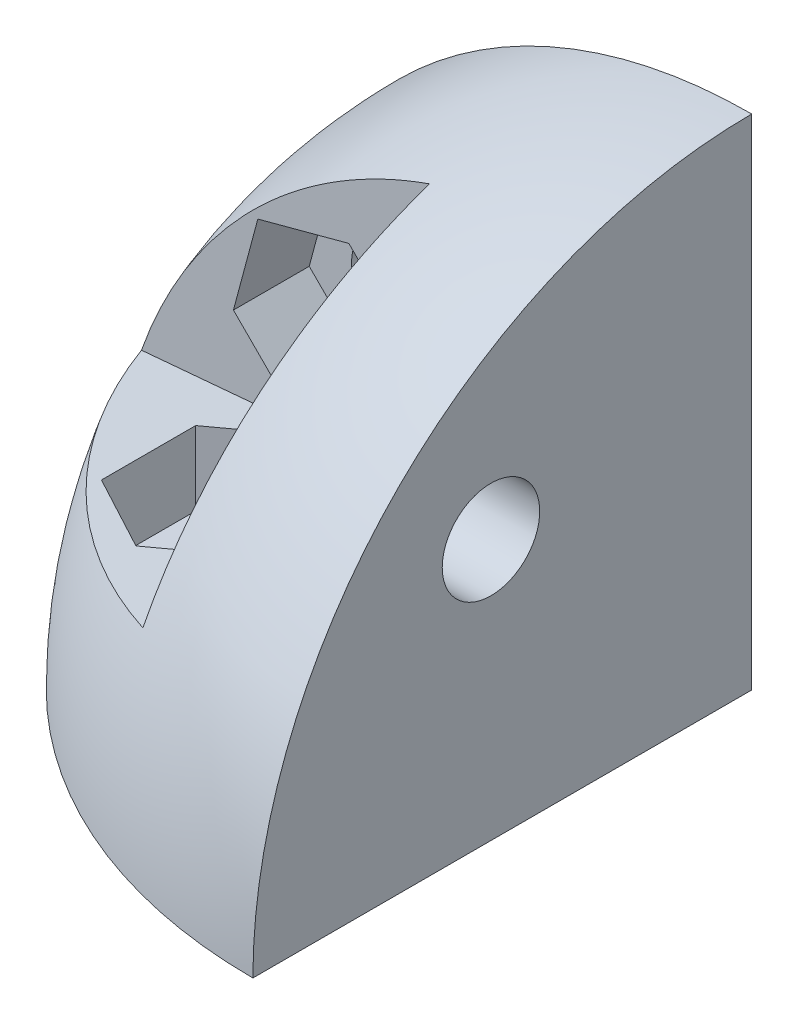
ISO-10303-21;
HEADER;
FILE_DESCRIPTION(('STEP AP214'),'2;1');
FILE_NAME('part.step','',(''),(''),'','','');
FILE_SCHEMA(('AUTOMOTIVE_DESIGN { 1 0 10303 214 1 1 1 1 }'));
ENDSEC;
DATA;
#1=APPLICATION_CONTEXT('core data for automotive mechanical design processes');
#2=APPLICATION_PROTOCOL_DEFINITION('international standard','automotive_design',2000,#1);
#3=PRODUCT_CONTEXT('',#1,'mechanical');
#4=PRODUCT('Part','Part','',(#3));
#5=PRODUCT_RELATED_PRODUCT_CATEGORY('part','',(#4));
#6=PRODUCT_DEFINITION_FORMATION('','',#4);
#7=PRODUCT_DEFINITION_CONTEXT('part definition',#1,'design');
#8=PRODUCT_DEFINITION('design','',#6,#7);
#9=PRODUCT_DEFINITION_SHAPE('','',#8);
#10=(LENGTH_UNIT() NAMED_UNIT(*) SI_UNIT(.MILLI.,.METRE.));
#11=(NAMED_UNIT(*) PLANE_ANGLE_UNIT() SI_UNIT($,.RADIAN.));
#12=(NAMED_UNIT(*) SI_UNIT($,.STERADIAN.) SOLID_ANGLE_UNIT());
#13=UNCERTAINTY_MEASURE_WITH_UNIT(LENGTH_MEASURE(1.E-05),#10,'distance_accuracy_value','');
#14=(GEOMETRIC_REPRESENTATION_CONTEXT(3) GLOBAL_UNCERTAINTY_ASSIGNED_CONTEXT((#13)) GLOBAL_UNIT_ASSIGNED_CONTEXT((#10,
#11,#12)) REPRESENTATION_CONTEXT('',''));
#15=CARTESIAN_POINT('',(0.,0.,0.));
#16=DIRECTION('',(0.,0.,1.));
#17=DIRECTION('',(1.,0.,0.));
#18=AXIS2_PLACEMENT_3D('',#15,#16,#17);
#19=CARTESIAN_POINT('',(-7.90000000000001,7.9,7.34307806183461));
#20=DIRECTION('',(0.,0.,-1.));
#21=DIRECTION('',(0.,1.,0.));
#22=AXIS2_PLACEMENT_3D('',#19,#20,#21);
#23=CONICAL_SURFACE('',#22,3.61416995083759,1.04889691310922);
#24=CARTESIAN_POINT('',(-13.7597303739018,7.16751282172458,6.0254597705994));
#25=CARTESIAN_POINT('',(-13.5178004933912,7.23233773783236,6.16811573450718));
#26=CARTESIAN_POINT('',(-13.2758174682111,7.29717689401142,6.3106760215065));
#27=CARTESIAN_POINT('',(-12.7916215190662,7.4269168075632,6.5954049431576));
#28=CARTESIAN_POINT('',(-12.5494085848063,7.49181756769452,6.73757355903885));
#29=CARTESIAN_POINT('',(-12.064677399873,7.62170089724359,7.02129048229639));
#30=CARTESIAN_POINT('',(-11.8221591838761,7.68668345736979,7.16283885315127));
#31=CARTESIAN_POINT('',(-11.3365695025941,7.81679682032218,7.44489817125003));
#32=CARTESIAN_POINT('',(-11.0934980564342,7.8819276180238,7.58540915366466));
#33=CARTESIAN_POINT('',(-10.7282803815609,7.97978739906767,7.79450328180227));
#34=CARTESIAN_POINT('',(-10.6065486806147,8.01240531002948,7.86386124092355));
#35=CARTESIAN_POINT('',(-10.3626612035475,8.07775476255368,8.00179346856782));
#36=CARTESIAN_POINT('',(-10.2405054007206,8.11048631127194,8.07036768652657));
#37=CARTESIAN_POINT('',(-9.99549346992604,8.17613706026432,8.20632282656691));
#38=CARTESIAN_POINT('',(-9.87263702354366,8.20905634585744,8.27370313749384));
#39=CARTESIAN_POINT('',(-9.68755556730266,8.25864877259119,8.37316938264805));
#40=CARTESIAN_POINT('',(-9.6257325429899,8.27521420202945,8.40605557517843));
#41=CARTESIAN_POINT('',(-9.5017270068239,8.30844138530211,8.47109198849914));
#42=CARTESIAN_POINT('',(-9.43954450226494,8.32510313718203,8.50324222415769));
#43=CARTESIAN_POINT('',(-9.31438674841064,8.35863905625379,8.56667379101767));
#44=CARTESIAN_POINT('',(-9.25140910796897,8.37551386415135,8.59795009460218));
#45=CARTESIAN_POINT('',(-9.1247826143018,8.40944333086985,8.65900342998442));
#46=CARTESIAN_POINT('',(-9.06113381331834,8.42649797569258,8.68878057744725));
#47=CARTESIAN_POINT('',(-8.93280023412669,8.46088485459878,8.74612780535509));
#48=CARTESIAN_POINT('',(-8.86811425358402,8.4782174108468,8.7736950626977));
#49=CARTESIAN_POINT('',(-8.73747712852891,8.51322152300684,8.82532191581052));
#50=CARTESIAN_POINT('',(-8.67152642462045,8.53089296085938,8.84938270891443));
#51=CARTESIAN_POINT('',(-8.51709917536303,8.57227161758726,8.89858079163729));
#52=CARTESIAN_POINT('',(-8.42797068818243,8.59615352374991,8.92174467704258));
#53=CARTESIAN_POINT('',(-8.29269334533905,8.63240097851902,8.94430765209405));
#54=CARTESIAN_POINT('',(-8.24751286721405,8.64450705114627,8.94980011196458));
#55=CARTESIAN_POINT('',(-8.15684785766095,8.66880066723778,8.95615976874845));
#56=CARTESIAN_POINT('',(-8.11136341795623,8.68098818612484,8.95702830300233));
#57=CARTESIAN_POINT('',(-8.02062808185029,8.7053006461594,8.95403125109313));
#58=CARTESIAN_POINT('',(-7.97537691392853,8.7174256600606,8.9501740840513));
#59=CARTESIAN_POINT('',(-7.88540088404932,8.74153466460489,8.93821796007714));
#60=CARTESIAN_POINT('',(-7.84067624732852,8.753518594896,8.93011725078673));
#61=CARTESIAN_POINT('',(-7.75121073540061,8.77749080656753,8.91031176938812));
#62=CARTESIAN_POINT('',(-7.70648224209259,8.78947577022807,8.89854866453492));
#63=CARTESIAN_POINT('',(-7.61778836241368,8.81324122366162,8.87231935173843));
#64=CARTESIAN_POINT('',(-7.57382295375336,8.82502171940705,8.85785322289519));
#65=CARTESIAN_POINT('',(-7.47555382565447,8.85135285292206,8.823018810311));
#66=CARTESIAN_POINT('',(-7.42144028821628,8.86585253157822,8.80208224754278));
#67=CARTESIAN_POINT('',(-7.31402932213911,8.89463321319684,8.75805886758644));
#68=CARTESIAN_POINT('',(-7.26073216014678,8.90891414471156,8.73497136458489));
#69=CARTESIAN_POINT('',(-7.15469912971838,8.93732560958587,8.6872669230047));
#70=CARTESIAN_POINT('',(-7.10196411681242,8.95145591370687,8.66264796041342));
#71=CARTESIAN_POINT('',(-6.99697375247636,8.97958799704376,8.61233414070121));
#72=CARTESIAN_POINT('',(-6.9447184341272,8.99358976739565,8.58663921004837));
#73=CARTESIAN_POINT('',(-6.79523800622912,9.0336429273352,8.51176631682021));
#74=CARTESIAN_POINT('',(-6.69846710412719,9.05957261240425,8.46161856166965));
#75=CARTESIAN_POINT('',(-6.55407764794885,9.0982616505828,8.38529203790327));
#76=CARTESIAN_POINT('',(-6.50615981433516,9.11110119540264,8.35971197804557));
#77=CARTESIAN_POINT('',(-6.41049067542616,9.13673566391389,8.3082297223605));
#78=CARTESIAN_POINT('',(-6.36273935705209,9.14953059110974,8.28232755259743));
#79=CARTESIAN_POINT('',(-6.31505188559596,9.16230841057549,8.25629889736301));
#80=B_SPLINE_CURVE_WITH_KNOTS('',3,(#24,#25,#26,#27,#28,#29,#30,#31,#32,#33,#34,#35,#36,#37,#38,
#39,#40,#41,#42,#43,#44,#45,#46,#47,#48,#49,#50,#51,#52,#53,#54,#55,#56,#57,#58,#59,#60,#61,#62,
#63,#64,#65,#66,#67,#68,#69,#70,#71,#72,#73,#74,#75,#76,#77,#78,#79),.UNSPECIFIED.,.F.,.F.,(4,2,
2,2,2,2,2,2,2,2,2,2,2,2,2,2,2,2,2,2,2,2,2,2,2,2,2,4),(0.,0.864724700397998,1.72949014524256,
2.59416491621447,3.45881023608813,3.8903607357934,4.32193892221933,4.75373199579712,
4.96960360827383,5.18547085573225,5.40239549859914,5.61930337924804,5.83648408132965,
6.05359044923052,6.3379193654596,6.47900690261222,6.62005363194258,6.76084944302319,
6.90170344119894,7.04492678117473,7.18814593058435,7.36749814669508,7.54690774510028,
7.7265597117487,7.90622397595402,8.24229724792111,8.40974197073303,8.57717323139248),.UNSPECIFIED.);
#81=CARTESIAN_POINT('',(-11.5118253101116,7.769837168229,7.34307806183461));
#82=VERTEX_POINT('',#81);
#83=CARTESIAN_POINT('',(-8.56061230866017,8.56061230866016,8.88426609820053));
#84=VERTEX_POINT('',#83);
#85=EDGE_CURVE('E14',#82,#84,#80,.T.);
#86=ORIENTED_EDGE('',*,*,#85,.F.);
#87=CARTESIAN_POINT('',(-7.90000000000001,7.9,7.34307806183461));
#88=DIRECTION('',(0.,0.,1.));
#89=DIRECTION('',(0.,-1.,0.));
#90=AXIS2_PLACEMENT_3D('',#87,#88,#89);
#91=CIRCLE('',#90,3.61416995083759);
#92=CARTESIAN_POINT('',(-11.5,7.58027444028144,7.34307806183461));
#93=VERTEX_POINT('',#92);
#94=EDGE_CURVE('E217',#82,#93,#91,.T.);
#95=ORIENTED_EDGE('',*,*,#94,.T.);
#96=DIRECTION('',(-0.863475111675209,-0.0766875176065022,-0.498527588164224));
#97=VECTOR('',#96,1.);
#98=CARTESIAN_POINT('',(-6.96632954410591,7.98292175252873,9.96059391996213));
#99=LINE('',#98,#97);
#100=CARTESIAN_POINT('',(-7.90000000000001,7.90000000000001,9.42153903091727));
#101=VERTEX_POINT('',#100);
#102=EDGE_CURVE('E513',#101,#93,#99,.T.);
#103=ORIENTED_EDGE('',*,*,#102,.F.);
#104=DIRECTION('',(-0.0766875176064967,-0.863475111675209,0.498527588164224));
#105=VECTOR('',#104,1.);
#106=CARTESIAN_POINT('',(-7.98292175252873,6.96632954410597,9.96059391996209));
#107=LINE('',#106,#105);
#108=CARTESIAN_POINT('',(-7.58027444028147,11.5,7.34307806183461));
#109=VERTEX_POINT('',#108);
#110=EDGE_CURVE('E213',#109,#101,#107,.T.);
#111=ORIENTED_EDGE('',*,*,#110,.F.);
#112=CARTESIAN_POINT('',(-7.76983716822902,11.5118253101116,7.34307806183461));
#113=VERTEX_POINT('',#112);
#114=EDGE_CURVE('E211',#109,#113,#91,.T.);
#115=ORIENTED_EDGE('',*,*,#114,.T.);
#116=CARTESIAN_POINT('',(-9.16230841057553,6.31505188559592,8.25629889736298));
#117=CARTESIAN_POINT('',(-9.15131051884169,6.35609657632275,8.27870128854848));
#118=CARTESIAN_POINT('',(-9.14029988177469,6.39718883328048,8.30101075960335));
#119=CARTESIAN_POINT('',(-9.11824692334722,6.47949159458901,8.34539807992014));
#120=CARTESIAN_POINT('',(-9.10720460093999,6.52070210284634,8.36747592141516));
#121=CARTESIAN_POINT('',(-9.07399500740762,6.64464199320784,8.43334446112058));
#122=CARTESIAN_POINT('',(-9.05177184020114,6.72757998232755,8.47671544062144));
#123=CARTESIAN_POINT('',(-9.00589763175845,6.89878485899267,8.56405968990096));
#124=CARTESIAN_POINT('',(-8.98223438833469,6.987097285722,8.6079385932012));
#125=CARTESIAN_POINT('',(-8.94645684449567,7.12062089709925,8.67133285985037));
#126=CARTESIAN_POINT('',(-8.93448642216689,7.16529512141832,8.69205617735777));
#127=CARTESIAN_POINT('',(-8.91042364088327,7.25509864374021,8.73241343491258));
#128=CARTESIAN_POINT('',(-8.89833129181012,7.30022790486405,8.75204746241734));
#129=CARTESIAN_POINT('',(-8.87294715958254,7.39496277604341,8.79147039562236));
#130=CARTESIAN_POINT('',(-8.85964154970348,7.44461998813778,8.8111278120254));
#131=CARTESIAN_POINT('',(-8.83279722978557,7.54480435396605,8.84800371140184));
#132=CARTESIAN_POINT('',(-8.81925844671882,7.5953317802438,8.86522141410471));
#133=CARTESIAN_POINT('',(-8.7921541324486,7.6964864582046,8.89591952223675));
#134=CARTESIAN_POINT('',(-8.77859332469238,7.74709608174249,8.90946073583373));
#135=CARTESIAN_POINT('',(-8.75122436714774,7.84923842184925,8.93195090515914));
#136=CARTESIAN_POINT('',(-8.73741651203937,7.90077003865724,8.94090499784522));
#137=CARTESIAN_POINT('',(-8.71162986716188,7.99700710749676,8.95217305518983));
#138=CARTESIAN_POINT('',(-8.69967423428852,8.04162613681679,8.9552579468438));
#139=CARTESIAN_POINT('',(-8.67574401673197,8.13093492457403,8.95682878479068));
#140=CARTESIAN_POINT('',(-8.66376943628545,8.17562466719974,8.95531564456287));
#141=CARTESIAN_POINT('',(-8.63982263839547,8.26499533360373,8.94785491567923));
#142=CARTESIAN_POINT('',(-8.62785116843735,8.30967346772871,8.94187281825179));
#143=CARTESIAN_POINT('',(-8.60407925778413,8.39839144607952,8.92609722513515));
#144=CARTESIAN_POINT('',(-8.59227887708705,8.4424310663897,8.91630242440032));
#145=CARTESIAN_POINT('',(-8.56301871616445,8.55163147359047,8.8880806719286));
#146=CARTESIAN_POINT('',(-8.54568176623283,8.61633385158357,8.86778680704895));
#147=CARTESIAN_POINT('',(-8.51138533838003,8.74432986284833,8.82283579749344));
#148=CARTESIAN_POINT('',(-8.49442630543215,8.80762183545705,8.7981737866594));
#149=CARTESIAN_POINT('',(-8.4607482430359,8.93331007542035,8.74596628894488));
#150=CARTESIAN_POINT('',(-8.44403016861376,8.99570277856846,8.71841172327577));
#151=CARTESIAN_POINT('',(-8.41081728814826,9.11965493593144,8.66145953035306));
#152=CARTESIAN_POINT('',(-8.39432238329088,9.18121475892519,8.63206275357608));
#153=CARTESIAN_POINT('',(-8.3612136693775,9.30477816142319,8.57150313464206));
#154=CARTESIAN_POINT('',(-8.34460248612695,9.36677194128806,8.54031897729466));
#155=CARTESIAN_POINT('',(-8.31149761359589,9.49032100755209,8.47703101129376));
#156=CARTESIAN_POINT('',(-8.29500392881916,9.55187627714288,8.44492716762242));
#157=CARTESIAN_POINT('',(-8.24572367477986,9.73579268902742,8.34777333394114));
#158=CARTESIAN_POINT('',(-8.21306635162302,9.85767147828793,8.28174707383435));
#159=CARTESIAN_POINT('',(-8.13649669664232,10.1434333209939,8.12476659074517));
#160=CARTESIAN_POINT('',(-8.09266701570675,10.307007917125,8.03321504466942));
#161=CARTESIAN_POINT('',(-8.00520432369021,10.6334231274975,7.84871060089658));
#162=CARTESIAN_POINT('',(-7.96157131998433,10.7962637142147,7.75575765120761));
#163=CARTESIAN_POINT('',(-7.87438369862073,11.1216523469347,7.56892766312902));
#164=CARTESIAN_POINT('',(-7.83082919574907,11.2841999645502,7.47504982639641));
#165=CARTESIAN_POINT('',(-7.74379818669774,11.6090041121637,7.28676259627722));
#166=CARTESIAN_POINT('',(-7.70032167932975,11.7712606465967,7.19235321108146));
#167=CARTESIAN_POINT('',(-7.61600595068742,12.0859312297671,7.00880009374929));
#168=CARTESIAN_POINT('',(-7.57516368937684,12.2383566240741,6.91967719578442));
#169=CARTESIAN_POINT('',(-7.4935127193536,12.5430821926881,6.74120052553764));
#170=CARTESIAN_POINT('',(-7.45270401080611,12.6953823663787,6.65184675212806));
#171=CARTESIAN_POINT('',(-7.37115388435736,12.9997315816491,6.473061114464));
#172=CARTESIAN_POINT('',(-7.33041244052443,13.1517807200073,6.38362942673361));
#173=CARTESIAN_POINT('',(-7.24894927901381,13.4558053777101,6.20463416812807));
#174=CARTESIAN_POINT('',(-7.20822756122176,13.6077808974815,6.11507059802995));
#175=CARTESIAN_POINT('',(-7.1675128217246,13.7597303739018,6.02545977059939));
#176=B_SPLINE_CURVE_WITH_KNOTS('',3,(#116,#117,#118,#119,#120,#121,#122,#123,#124,#125,#126,
#127,#128,#129,#130,#131,#132,#133,#134,#135,#136,#137,#138,#139,#140,#141,#142,#143,#144,#145,
#146,#147,#148,#149,#150,#151,#152,#153,#154,#155,#156,#157,#158,#159,#160,#161,#162,#163,#164,
#165,#166,#167,#168,#169,#170,#171,#172,#173,#174,#175),.UNSPECIFIED.,.F.,.F.,(4,2,2,2,2,2,2,2,
2,2,2,2,2,2,2,2,2,2,2,2,2,2,2,2,2,2,2,2,2,4),(0.,0.144109129487193,0.288223075839349,
0.576801596778372,0.880993045754002,1.03302504839892,1.18504482692057,1.35011921034829,
1.51524626936564,1.67744782652353,1.839467340516,1.97813926064037,2.1167836329696,
2.25650981278575,2.39628386142327,2.60600031228338,2.81595187586138,3.02658331390726,
3.23711821798959,3.45117452777935,3.66523899880671,4.0924465212826,4.66995974544885,
5.24749444825678,5.82558117150965,6.4036590110484,6.94735015991855,7.49104396934776,
8.03417509269707,8.57730302867369),.UNSPECIFIED.);
#177=EDGE_CURVE('E65',#84,#113,#176,.T.);
#178=ORIENTED_EDGE('',*,*,#177,.F.);
#179=EDGE_LOOP('',(#86,#95,#103,#111,#115,#178));
#180=FACE_BOUND('',#179,.T.);
#181=ADVANCED_FACE('F51',(#180),#23,.T.);
#182=CARTESIAN_POINT('',(-7.90000000000001,7.9,7.34307806183461));
#183=DIRECTION('',(0.,0.,1.));
#184=DIRECTION('',(0.,-1.,0.));
#185=AXIS2_PLACEMENT_3D('',#182,#183,#184);
#186=PLANE('',#185);
#187=DIRECTION('',(0.996079334665958,0.0884644507778252,0.));
#188=VECTOR('',#187,1.);
#189=CARTESIAN_POINT('',(-7.90000000000001,7.9,7.34307806183461));
#190=LINE('',#189,#188);
#191=CARTESIAN_POINT('',(-12.5758905666017,7.48472174205848,7.34307806183461));
#192=VERTEX_POINT('',#191);
#193=EDGE_CURVE('E560',#192,#93,#190,.T.);
#194=ORIENTED_EDGE('',*,*,#193,.T.);
#195=ORIENTED_EDGE('',*,*,#94,.F.);
#196=DIRECTION('',(-0.965925826289068,-0.258819045102521,0.));
#197=VECTOR('',#196,1.);
#198=CARTESIAN_POINT('',(-8.56061230866023,8.56061230866013,7.34307806183461));
#199=LINE('',#198,#197);
#200=EDGE_CURVE('E224',#82,#192,#199,.T.);
#201=ORIENTED_EDGE('',*,*,#200,.T.);
#202=EDGE_LOOP('',(#194,#195,#201));
#203=FACE_BOUND('',#202,.T.);
#204=ADVANCED_FACE('F370',(#203),#186,.T.);
#205=DIRECTION('',(-0.258819045102521,-0.965925826289068,0.));
#206=VECTOR('',#205,1.);
#207=CARTESIAN_POINT('',(-7.48472174205852,12.5758905666016,7.34307806183461));
#208=LINE('',#207,#206);
#209=CARTESIAN_POINT('',(-7.48472174205855,12.5758905666013,7.34307806183461));
#210=VERTEX_POINT('',#209);
#211=EDGE_CURVE('E205',#210,#113,#208,.T.);
#212=ORIENTED_EDGE('',*,*,#211,.T.);
#213=ORIENTED_EDGE('',*,*,#114,.F.);
#214=DIRECTION('',(-0.0884644507778189,-0.996079334665959,0.));
#215=VECTOR('',#214,1.);
#216=CARTESIAN_POINT('',(-7.90000000000001,7.9,7.34307806183461));
#217=LINE('',#216,#215);
#218=EDGE_CURVE('E216',#210,#109,#217,.T.);
#219=ORIENTED_EDGE('',*,*,#218,.F.);
#220=EDGE_LOOP('',(#212,#213,#219));
#221=FACE_BOUND('',#220,.T.);
#222=ADVANCED_FACE('F219',(#221),#186,.T.);
#223=CARTESIAN_POINT('',(-11.5,22.,15.6569219381652));
#224=DIRECTION('',(-0.5,0.,-0.866025403784439));
#225=DIRECTION('',(-0.866025403784439,0.,0.5));
#226=AXIS2_PLACEMENT_3D('',#223,#224,#225);
#227=PLANE('',#226);
#228=DIRECTION('',(0.,-1.,0.));
#229=VECTOR('',#228,1.);
#230=CARTESIAN_POINT('',(-11.5,22.,15.6569219381652));
#231=LINE('',#230,#229);
#232=CARTESIAN_POINT('',(-11.5,7.58027444028144,15.6569219381652));
#233=VERTEX_POINT('',#232);
#234=CARTESIAN_POINT('',(-11.5,4.,15.6569219381652));
#235=VERTEX_POINT('',#234);
#236=EDGE_CURVE('E323',#233,#235,#231,.T.);
#237=ORIENTED_EDGE('',*,*,#236,.F.);
#238=DIRECTION('',(0.863475111675209,0.0766875176065021,-0.498527588164224));
#239=VECTOR('',#238,1.);
#240=CARTESIAN_POINT('',(-10.545158032822,7.66507649094776,15.1056436713814));
#241=LINE('',#240,#239);
#242=CARTESIAN_POINT('',(-7.90000000000001,7.9,13.5784609690826));
#243=VERTEX_POINT('',#242);
#244=EDGE_CURVE('E545',#233,#243,#241,.T.);
#245=ORIENTED_EDGE('',*,*,#244,.T.);
#246=DIRECTION('',(0.,-1.,0.));
#247=VECTOR('',#246,1.);
#248=CARTESIAN_POINT('',(-7.90000000000001,22.,13.5784609690826));
#249=LINE('',#248,#247);
#250=CARTESIAN_POINT('',(-7.90000000000001,4.,13.5784609690826));
#251=VERTEX_POINT('',#250);
#252=EDGE_CURVE('E321',#243,#251,#249,.T.);
#253=ORIENTED_EDGE('',*,*,#252,.T.);
#254=DIRECTION('',(0.866025403784439,0.,-0.5));
#255=VECTOR('',#254,1.);
#256=CARTESIAN_POINT('',(-11.5,4.,15.6569219381652));
#257=LINE('',#256,#255);
#258=EDGE_CURVE('E318',#235,#251,#257,.T.);
#259=ORIENTED_EDGE('',*,*,#258,.F.);
#260=EDGE_LOOP('',(#237,#245,#253,#259));
#261=FACE_BOUND('',#260,.T.);
#262=ADVANCED_FACE('F452',(#261),#227,.T.);
#263=CARTESIAN_POINT('',(0.,0.,0.));
#264=DIRECTION('',(0.,1.,0.));
#265=DIRECTION('',(1.,0.,0.));
#266=AXIS2_PLACEMENT_3D('',#263,#264,#265);
#267=SPHERICAL_SURFACE('',#266,22.);
#268=CARTESIAN_POINT('',(0.,0.,0.));
#269=DIRECTION('',(0.,0.,1.));
#270=DIRECTION('',(1.,0.,0.));
#271=AXIS2_PLACEMENT_3D('',#268,#269,#270);
#272=CIRCLE('',#271,22.);
#273=CARTESIAN_POINT('',(0.,22.,0.));
#274=VERTEX_POINT('',#273);
#275=CARTESIAN_POINT('',(-22.,0.,0.));
#276=VERTEX_POINT('',#275);
#277=EDGE_CURVE('E349',#274,#276,#272,.T.);
#278=ORIENTED_EDGE('',*,*,#277,.T.);
#279=CARTESIAN_POINT('',(0.,0.,0.));
#280=DIRECTION('',(0.,1.,0.));
#281=DIRECTION('',(0.,0.,1.));
#282=AXIS2_PLACEMENT_3D('',#279,#280,#281);
#283=CIRCLE('',#282,22.);
#284=CARTESIAN_POINT('',(0.,0.,22.));
#285=VERTEX_POINT('',#284);
#286=EDGE_CURVE('E352',#276,#285,#283,.T.);
#287=ORIENTED_EDGE('',*,*,#286,.T.);
#288=CARTESIAN_POINT('',(0.,0.,0.));
#289=DIRECTION('',(1.,0.,0.));
#290=DIRECTION('',(0.,0.,-1.));
#291=AXIS2_PLACEMENT_3D('',#288,#289,#290);
#292=CIRCLE('',#291,22.);
#293=EDGE_CURVE('E340',#274,#285,#292,.T.);
#294=ORIENTED_EDGE('',*,*,#293,.F.);
#295=EDGE_LOOP('',(#278,#287,#294));
#296=FACE_BOUND('',#295,.T.);
#297=CARTESIAN_POINT('',(-8.53430405254542,0.757954205557869,0.));
#298=DIRECTION('',(0.996079334665959,-0.0884644507778189,0.));
#299=DIRECTION('',(0.0884644507778189,0.996079334665959,0.));
#300=AXIS2_PLACEMENT_3D('',#297,#298,#299);
#301=CIRCLE('',#300,20.2630491229969);
#302=CARTESIAN_POINT('',(-7.90000000000001,7.9,18.9520447445652));
#303=VERTEX_POINT('',#302);
#304=CARTESIAN_POINT('',(-6.86358933537471,19.5696281521426,7.34307806183461));
#305=VERTEX_POINT('',#304);
#306=EDGE_CURVE('E500',#303,#305,#301,.F.);
#307=ORIENTED_EDGE('',*,*,#306,.F.);
#308=CARTESIAN_POINT('',(-0.757954205557925,8.53430405254545,0.));
#309=DIRECTION('',(-0.0884644507778252,0.996079334665958,0.));
#310=DIRECTION('',(-0.996079334665958,-0.0884644507778252,0.));
#311=AXIS2_PLACEMENT_3D('',#308,#309,#310);
#312=CIRCLE('',#311,20.2630491229968);
#313=CARTESIAN_POINT('',(-19.5696281521427,6.86358933537463,7.34307806183461));
#314=VERTEX_POINT('',#313);
#315=EDGE_CURVE('E501',#303,#314,#312,.F.);
#316=ORIENTED_EDGE('',*,*,#315,.T.);
#317=CARTESIAN_POINT('',(0.,0.,7.34307806183462));
#318=DIRECTION('',(0.,0.,1.));
#319=DIRECTION('',(0.,-1.,0.));
#320=AXIS2_PLACEMENT_3D('',#317,#318,#319);
#321=CIRCLE('',#320,20.7383510573479);
#322=EDGE_CURVE('E231',#314,#305,#321,.F.);
#323=ORIENTED_EDGE('',*,*,#322,.T.);
#324=EDGE_LOOP('',(#307,#316,#323));
#325=FACE_BOUND('',#324,.T.);
#326=ADVANCED_FACE('F53',(#296,#325),#267,.T.);
#327=CARTESIAN_POINT('',(-7.90000000000001,22.,9.42153903091727));
#328=DIRECTION('',(-0.5,0.,0.866025403784439));
#329=DIRECTION('',(0.866025403784439,0.,0.5));
#330=AXIS2_PLACEMENT_3D('',#327,#328,#329);
#331=PLANE('',#330);
#332=DIRECTION('',(0.,-1.,0.));
#333=VECTOR('',#332,1.);
#334=CARTESIAN_POINT('',(-7.90000000000001,22.,9.42153903091727));
#335=LINE('',#334,#333);
#336=CARTESIAN_POINT('',(-7.90000000000001,4.,9.42153903091727));
#337=VERTEX_POINT('',#336);
#338=EDGE_CURVE('E331',#101,#337,#335,.T.);
#339=ORIENTED_EDGE('',*,*,#338,.F.);
#340=ORIENTED_EDGE('',*,*,#102,.T.);
#341=DIRECTION('',(0.,-1.,0.));
#342=VECTOR('',#341,1.);
#343=CARTESIAN_POINT('',(-11.5,22.,7.34307806183461));
#344=LINE('',#343,#342);
#345=CARTESIAN_POINT('',(-11.5,4.,7.34307806183461));
#346=VERTEX_POINT('',#345);
#347=EDGE_CURVE('E329',#93,#346,#344,.T.);
#348=ORIENTED_EDGE('',*,*,#347,.T.);
#349=DIRECTION('',(-0.866025403784438,0.,-0.5));
#350=VECTOR('',#349,1.);
#351=CARTESIAN_POINT('',(-7.90000000000001,4.,9.42153903091727));
#352=LINE('',#351,#350);
#353=EDGE_CURVE('E306',#337,#346,#352,.T.);
#354=ORIENTED_EDGE('',*,*,#353,.F.);
#355=EDGE_LOOP('',(#339,#340,#348,#354));
#356=FACE_BOUND('',#355,.T.);
#357=ADVANCED_FACE('F466',(#356),#331,.T.);
#358=CARTESIAN_POINT('',(-11.5,22.,7.34307806183461));
#359=DIRECTION('',(0.5,0.,0.866025403784438));
#360=DIRECTION('',(0.866025403784439,0.,-0.5));
#361=AXIS2_PLACEMENT_3D('',#358,#359,#360);
#362=PLANE('',#361);
#363=ORIENTED_EDGE('',*,*,#347,.F.);
#364=DIRECTION('',(-0.863475111675209,-0.0766875176065021,0.498527588164224));
#365=VECTOR('',#364,1.);
#366=CARTESIAN_POINT('',(-10.545158032822,7.66507649094776,6.79179979505082));
#367=LINE('',#366,#365);
#368=CARTESIAN_POINT('',(-15.1,7.26054888056287,9.42153903091727));
#369=VERTEX_POINT('',#368);
#370=EDGE_CURVE('E555',#93,#369,#367,.T.);
#371=ORIENTED_EDGE('',*,*,#370,.T.);
#372=DIRECTION('',(0.,-1.,0.));
#373=VECTOR('',#372,1.);
#374=CARTESIAN_POINT('',(-15.1,22.,9.42153903091727));
#375=LINE('',#374,#373);
#376=CARTESIAN_POINT('',(-15.1,4.,9.42153903091727));
#377=VERTEX_POINT('',#376);
#378=EDGE_CURVE('E327',#369,#377,#375,.T.);
#379=ORIENTED_EDGE('',*,*,#378,.T.);
#380=DIRECTION('',(-0.866025403784438,0.,0.5));
#381=VECTOR('',#380,1.);
#382=CARTESIAN_POINT('',(-11.5,4.,7.34307806183461));
#383=LINE('',#382,#381);
#384=EDGE_CURVE('E309',#346,#377,#383,.T.);
#385=ORIENTED_EDGE('',*,*,#384,.F.);
#386=EDGE_LOOP('',(#363,#371,#379,#385));
#387=FACE_BOUND('',#386,.T.);
#388=ADVANCED_FACE('F462',(#387),#362,.T.);
#389=CARTESIAN_POINT('',(-15.1,22.,9.42153903091727));
#390=DIRECTION('',(1.,0.,0.));
#391=DIRECTION('',(0.,0.,-1.));
#392=AXIS2_PLACEMENT_3D('',#389,#390,#391);
#393=PLANE('',#392);
#394=ORIENTED_EDGE('',*,*,#378,.F.);
#395=DIRECTION('',(0.,0.,1.));
#396=VECTOR('',#395,1.);
#397=CARTESIAN_POINT('',(-15.1,7.26054888056287,9.42153903091727));
#398=LINE('',#397,#396);
#399=CARTESIAN_POINT('',(-15.1,7.26054888056287,13.5784609690826));
#400=VERTEX_POINT('',#399);
#401=EDGE_CURVE('E546',#369,#400,#398,.T.);
#402=ORIENTED_EDGE('',*,*,#401,.T.);
#403=DIRECTION('',(0.,-1.,0.));
#404=VECTOR('',#403,1.);
#405=CARTESIAN_POINT('',(-15.1,22.,13.5784609690826));
#406=LINE('',#405,#404);
#407=CARTESIAN_POINT('',(-15.1,4.,13.5784609690826));
#408=VERTEX_POINT('',#407);
#409=EDGE_CURVE('E325',#400,#408,#406,.T.);
#410=ORIENTED_EDGE('',*,*,#409,.T.);
#411=DIRECTION('',(0.,0.,1.));
#412=VECTOR('',#411,1.);
#413=CARTESIAN_POINT('',(-15.1,4.,9.42153903091727));
#414=LINE('',#413,#412);
#415=EDGE_CURVE('E312',#377,#408,#414,.T.);
#416=ORIENTED_EDGE('',*,*,#415,.F.);
#417=EDGE_LOOP('',(#394,#402,#410,#416));
#418=FACE_BOUND('',#417,.T.);
#419=ADVANCED_FACE('F458',(#418),#393,.T.);
#420=CARTESIAN_POINT('',(-15.1,22.,13.5784609690826));
#421=DIRECTION('',(0.5,0.,-0.866025403784438));
#422=DIRECTION('',(-0.866025403784439,0.,-0.5));
#423=AXIS2_PLACEMENT_3D('',#420,#421,#422);
#424=PLANE('',#423);
#425=ORIENTED_EDGE('',*,*,#409,.F.);
#426=DIRECTION('',(0.863475111675209,0.0766875176065022,0.498527588164224));
#427=VECTOR('',#426,1.);
#428=CARTESIAN_POINT('',(-14.1239865215381,7.34723122936679,14.1419626136053));
#429=LINE('',#428,#427);
#430=EDGE_CURVE('E549',#400,#233,#429,.T.);
#431=ORIENTED_EDGE('',*,*,#430,.T.);
#432=ORIENTED_EDGE('',*,*,#236,.T.);
#433=DIRECTION('',(0.866025403784439,0.,0.5));
#434=VECTOR('',#433,1.);
#435=CARTESIAN_POINT('',(-15.1,4.,13.5784609690826));
#436=LINE('',#435,#434);
#437=EDGE_CURVE('E315',#408,#235,#436,.T.);
#438=ORIENTED_EDGE('',*,*,#437,.F.);
#439=EDGE_LOOP('',(#425,#431,#432,#438));
#440=FACE_BOUND('',#439,.T.);
#441=ADVANCED_FACE('F402',(#440),#424,.T.);
#442=CARTESIAN_POINT('',(-15.5152782579415,10.4241094333983,22.));
#443=DIRECTION('',(-0.965925826289068,0.258819045102521,0.));
#444=DIRECTION('',(-0.258819045102521,-0.965925826289068,0.));
#445=AXIS2_PLACEMENT_3D('',#442,#443,#444);
#446=PLANE('',#445);
#447=DIRECTION('',(0.258819045102521,0.965925826289068,0.));
#448=VECTOR('',#447,1.);
#449=CARTESIAN_POINT('',(-15.5152782579415,10.4241094333983,7.34307806183461));
#450=LINE('',#449,#448);
#451=CARTESIAN_POINT('',(-15.5152782579415,10.4241094333983,7.34307806183461));
#452=VERTEX_POINT('',#451);
#453=CARTESIAN_POINT('',(-14.4393876913398,14.4393876913398,7.34307806183461));
#454=VERTEX_POINT('',#453);
#455=EDGE_CURVE('E222',#452,#454,#450,.T.);
#456=ORIENTED_EDGE('',*,*,#455,.F.);
#457=DIRECTION('',(0.,0.,-1.));
#458=VECTOR('',#457,1.);
#459=CARTESIAN_POINT('',(-15.5152782579415,10.4241094333983,22.));
#460=LINE('',#459,#458);
#461=CARTESIAN_POINT('',(-15.5152782579415,10.4241094333983,3.99999999999995));
#462=VERTEX_POINT('',#461);
#463=EDGE_CURVE('E258',#452,#462,#460,.T.);
#464=ORIENTED_EDGE('',*,*,#463,.T.);
#465=DIRECTION('',(0.258819045102521,0.965925826289068,0.));
#466=VECTOR('',#465,1.);
#467=CARTESIAN_POINT('',(-15.5152782579415,10.4241094333983,3.99999999999995));
#468=LINE('',#467,#466);
#469=CARTESIAN_POINT('',(-14.4393876913398,14.4393876913398,3.99999999999995));
#470=VERTEX_POINT('',#469);
#471=EDGE_CURVE('E242',#462,#470,#468,.T.);
#472=ORIENTED_EDGE('',*,*,#471,.T.);
#473=DIRECTION('',(0.,0.,-1.));
#474=VECTOR('',#473,1.);
#475=CARTESIAN_POINT('',(-14.4393876913399,14.4393876913398,22.));
#476=LINE('',#475,#474);
#477=EDGE_CURVE('E256',#454,#470,#476,.T.);
#478=ORIENTED_EDGE('',*,*,#477,.F.);
#479=EDGE_LOOP('',(#456,#464,#472,#478));
#480=FACE_BOUND('',#479,.T.);
#481=ADVANCED_FACE('F399',(#480),#446,.F.);
#482=CARTESIAN_POINT('',(-12.5758905666017,7.48472174205848,22.));
#483=DIRECTION('',(-0.707106781186548,-0.707106781186547,0.));
#484=DIRECTION('',(0.707106781186547,-0.707106781186548,0.));
#485=AXIS2_PLACEMENT_3D('',#482,#483,#484);
#486=PLANE('',#485);
#487=DIRECTION('',(-0.707106781186547,0.707106781186548,0.));
#488=VECTOR('',#487,1.);
#489=CARTESIAN_POINT('',(-12.5758905666017,7.4847217420585,7.34307806183461));
#490=LINE('',#489,#488);
#491=EDGE_CURVE('E221',#192,#452,#490,.T.);
#492=ORIENTED_EDGE('',*,*,#491,.F.);
#493=DIRECTION('',(0.,0.,-1.));
#494=VECTOR('',#493,1.);
#495=CARTESIAN_POINT('',(-12.5758905666017,7.48472174205848,22.));
#496=LINE('',#495,#494);
#497=CARTESIAN_POINT('',(-12.5758905666017,7.48472174205848,3.99999999999996));
#498=VERTEX_POINT('',#497);
#499=EDGE_CURVE('E260',#192,#498,#496,.T.);
#500=ORIENTED_EDGE('',*,*,#499,.T.);
#501=DIRECTION('',(-0.707106781186547,0.707106781186548,0.));
#502=VECTOR('',#501,1.);
#503=CARTESIAN_POINT('',(-12.5758905666017,7.48472174205848,3.99999999999996));
#504=LINE('',#503,#502);
#505=EDGE_CURVE('E239',#498,#462,#504,.T.);
#506=ORIENTED_EDGE('',*,*,#505,.T.);
#507=ORIENTED_EDGE('',*,*,#463,.F.);
#508=EDGE_LOOP('',(#492,#500,#506,#507));
#509=FACE_BOUND('',#508,.T.);
#510=ADVANCED_FACE('F391',(#509),#486,.F.);
#511=CARTESIAN_POINT('',(-10.4241094333984,15.5152782579414,22.));
#512=DIRECTION('',(0.707106781186548,0.707106781186548,0.));
#513=DIRECTION('',(-0.707106781186548,0.707106781186548,0.));
#514=AXIS2_PLACEMENT_3D('',#511,#512,#513);
#515=PLANE('',#514);
#516=DIRECTION('',(0.707106781186548,-0.707106781186548,0.));
#517=VECTOR('',#516,1.);
#518=CARTESIAN_POINT('',(-10.4241094333984,15.5152782579415,7.34307806183461));
#519=LINE('',#518,#517);
#520=CARTESIAN_POINT('',(-10.4241094333983,15.5152782579414,7.34307806183461));
#521=VERTEX_POINT('',#520);
#522=EDGE_CURVE('E226',#521,#210,#519,.T.);
#523=ORIENTED_EDGE('',*,*,#522,.F.);
#524=DIRECTION('',(0.,0.,-1.));
#525=VECTOR('',#524,1.);
#526=CARTESIAN_POINT('',(-10.4241094333984,15.5152782579414,22.));
#527=LINE('',#526,#525);
#528=CARTESIAN_POINT('',(-10.4241094333983,15.5152782579414,3.99999999999996));
#529=VERTEX_POINT('',#528);
#530=EDGE_CURVE('E254',#521,#529,#527,.T.);
#531=ORIENTED_EDGE('',*,*,#530,.T.);
#532=DIRECTION('',(0.707106781186548,-0.707106781186548,0.));
#533=VECTOR('',#532,1.);
#534=CARTESIAN_POINT('',(-10.4241094333983,15.5152782579414,3.99999999999996));
#535=LINE('',#534,#533);
#536=CARTESIAN_POINT('',(-7.48472174205851,12.5758905666016,3.99999999999997));
#537=VERTEX_POINT('',#536);
#538=EDGE_CURVE('E248',#529,#537,#535,.T.);
#539=ORIENTED_EDGE('',*,*,#538,.T.);
#540=DIRECTION('',(0.,0.,-1.));
#541=VECTOR('',#540,1.);
#542=CARTESIAN_POINT('',(-7.48472174205857,12.5758905666016,22.0000000000001));
#543=LINE('',#542,#541);
#544=EDGE_CURVE('E251',#210,#537,#543,.T.);
#545=ORIENTED_EDGE('',*,*,#544,.F.);
#546=EDGE_LOOP('',(#523,#531,#539,#545));
#547=FACE_BOUND('',#546,.T.);
#548=ADVANCED_FACE('F388',(#547),#515,.F.);
#549=CARTESIAN_POINT('',(-7.48472174205857,12.5758905666016,22.0000000000001));
#550=DIRECTION('',(0.965925826289068,-0.258819045102521,0.));
#551=DIRECTION('',(0.258819045102521,0.965925826289068,0.));
#552=AXIS2_PLACEMENT_3D('',#549,#550,#551);
#553=PLANE('',#552);
#554=ORIENTED_EDGE('',*,*,#211,.F.);
#555=ORIENTED_EDGE('',*,*,#544,.T.);
#556=DIRECTION('',(-0.258819045102521,-0.965925826289068,0.));
#557=VECTOR('',#556,1.);
#558=CARTESIAN_POINT('',(-7.48472174205851,12.5758905666016,3.99999999999997));
#559=LINE('',#558,#557);
#560=CARTESIAN_POINT('',(-8.56061230866017,8.56061230866015,3.99999999999997));
#561=VERTEX_POINT('',#560);
#562=EDGE_CURVE('E234',#537,#561,#559,.T.);
#563=ORIENTED_EDGE('',*,*,#562,.T.);
#564=DIRECTION('',(0.,0.,-1.));
#565=VECTOR('',#564,1.);
#566=CARTESIAN_POINT('',(-8.56061230866024,8.56061230866015,22.));
#567=LINE('',#566,#565);
#568=EDGE_CURVE('E72',#84,#561,#567,.T.);
#569=ORIENTED_EDGE('',*,*,#568,.F.);
#570=ORIENTED_EDGE('',*,*,#177,.T.);
#571=EDGE_LOOP('',(#554,#555,#563,#569,#570));
#572=FACE_BOUND('',#571,.T.);
#573=ADVANCED_FACE('F203',(#572),#553,.F.);
#574=CARTESIAN_POINT('',(-8.56061230866024,8.56061230866015,22.));
#575=DIRECTION('',(0.258819045102521,-0.965925826289068,0.));
#576=DIRECTION('',(0.965925826289068,0.258819045102521,0.));
#577=AXIS2_PLACEMENT_3D('',#574,#575,#576);
#578=PLANE('',#577);
#579=ORIENTED_EDGE('',*,*,#200,.F.);
#580=ORIENTED_EDGE('',*,*,#85,.T.);
#581=ORIENTED_EDGE('',*,*,#568,.T.);
#582=DIRECTION('',(-0.965925826289068,-0.258819045102521,0.));
#583=VECTOR('',#582,1.);
#584=CARTESIAN_POINT('',(-8.56061230866017,8.56061230866015,3.99999999999997));
#585=LINE('',#584,#583);
#586=EDGE_CURVE('E236',#561,#498,#585,.T.);
#587=ORIENTED_EDGE('',*,*,#586,.T.);
#588=ORIENTED_EDGE('',*,*,#499,.F.);
#589=EDGE_LOOP('',(#579,#580,#581,#587,#588));
#590=FACE_BOUND('',#589,.T.);
#591=ADVANCED_FACE('F397',(#590),#578,.F.);
#592=CARTESIAN_POINT('',(-14.4393876913399,14.4393876913398,22.));
#593=DIRECTION('',(-0.258819045102521,0.965925826289068,0.));
#594=DIRECTION('',(-0.965925826289068,-0.258819045102521,0.));
#595=AXIS2_PLACEMENT_3D('',#592,#593,#594);
#596=PLANE('',#595);
#597=DIRECTION('',(0.965925826289068,0.258819045102521,0.));
#598=VECTOR('',#597,1.);
#599=CARTESIAN_POINT('',(-14.4393876913399,14.4393876913398,7.34307806183461));
#600=LINE('',#599,#598);
#601=EDGE_CURVE('E208',#454,#521,#600,.T.);
#602=ORIENTED_EDGE('',*,*,#601,.F.);
#603=ORIENTED_EDGE('',*,*,#477,.T.);
#604=DIRECTION('',(0.965925826289068,0.258819045102521,0.));
#605=VECTOR('',#604,1.);
#606=CARTESIAN_POINT('',(-14.4393876913398,14.4393876913398,3.99999999999995));
#607=LINE('',#606,#605);
#608=EDGE_CURVE('E245',#470,#529,#607,.T.);
#609=ORIENTED_EDGE('',*,*,#608,.T.);
#610=ORIENTED_EDGE('',*,*,#530,.F.);
#611=EDGE_LOOP('',(#602,#603,#609,#610));
#612=FACE_BOUND('',#611,.T.);
#613=ADVANCED_FACE('F393',(#612),#596,.F.);
#614=CARTESIAN_POINT('',(-22.,11.5,11.4999999999999));
#615=DIRECTION('',(1.,0.,0.));
#616=DIRECTION('',(0.,1.,0.));
#617=AXIS2_PLACEMENT_3D('',#614,#615,#616);
#618=CYLINDRICAL_SURFACE('',#617,2.15);
#619=CARTESIAN_POINT('',(0.,11.5,11.4999999999999));
#620=DIRECTION('',(1.,0.,0.));
#621=DIRECTION('',(0.,0.,1.));
#622=AXIS2_PLACEMENT_3D('',#619,#620,#621);
#623=CIRCLE('',#622,2.15);
#624=CARTESIAN_POINT('',(0.,11.5,13.6499999999999));
#625=VERTEX_POINT('',#624);
#626=EDGE_CURVE('E297',#625,#625,#623,.T.);
#627=ORIENTED_EDGE('',*,*,#626,.T.);
#628=EDGE_LOOP('',(#627));
#629=FACE_BOUND('',#628,.T.);
#630=CARTESIAN_POINT('',(-4.,11.5,11.4999999999999));
#631=DIRECTION('',(-1.,0.,0.));
#632=DIRECTION('',(0.,-1.,0.));
#633=AXIS2_PLACEMENT_3D('',#630,#631,#632);
#634=CIRCLE('',#633,2.15);
#635=CARTESIAN_POINT('',(-4.,9.35000000000001,11.4999999999999));
#636=VERTEX_POINT('',#635);
#637=EDGE_CURVE('E293',#636,#636,#634,.F.);
#638=ORIENTED_EDGE('',*,*,#637,.F.);
#639=EDGE_LOOP('',(#638));
#640=FACE_BOUND('',#639,.T.);
#641=ADVANCED_FACE('F396',(#629,#640),#618,.F.);
#642=CARTESIAN_POINT('',(-11.5,22.,11.4999999999999));
#643=DIRECTION('',(0.,-1.,0.));
#644=DIRECTION('',(0.,0.,-1.));
#645=AXIS2_PLACEMENT_3D('',#642,#643,#644);
#646=CYLINDRICAL_SURFACE('',#645,2.15);
#647=CARTESIAN_POINT('',(-11.5,0.,11.4999999999999));
#648=DIRECTION('',(0.,1.,0.));
#649=DIRECTION('',(0.,0.,1.));
#650=AXIS2_PLACEMENT_3D('',#647,#648,#649);
#651=CIRCLE('',#650,2.15);
#652=CARTESIAN_POINT('',(-11.5,0.,13.6499999999999));
#653=VERTEX_POINT('',#652);
#654=EDGE_CURVE('E334',#653,#653,#651,.T.);
#655=ORIENTED_EDGE('',*,*,#654,.F.);
#656=EDGE_LOOP('',(#655));
#657=FACE_BOUND('',#656,.T.);
#658=CARTESIAN_POINT('',(-11.5,4.,11.4999999999999));
#659=DIRECTION('',(0.,1.,0.));
#660=DIRECTION('',(0.,0.,1.));
#661=AXIS2_PLACEMENT_3D('',#658,#659,#660);
#662=CIRCLE('',#661,2.15);
#663=CARTESIAN_POINT('',(-11.5,4.,13.6499999999999));
#664=VERTEX_POINT('',#663);
#665=EDGE_CURVE('E333',#664,#664,#662,.T.);
#666=ORIENTED_EDGE('',*,*,#665,.T.);
#667=EDGE_LOOP('',(#666));
#668=FACE_BOUND('',#667,.T.);
#669=ADVANCED_FACE('F442',(#657,#668),#646,.F.);
#670=CARTESIAN_POINT('',(-22.,0.,0.));
#671=DIRECTION('',(0.,-1.,0.));
#672=DIRECTION('',(0.,0.,-1.));
#673=AXIS2_PLACEMENT_3D('',#670,#671,#672);
#674=PLANE('',#673);
#675=ORIENTED_EDGE('',*,*,#654,.T.);
#676=EDGE_LOOP('',(#675));
#677=FACE_BOUND('',#676,.T.);
#678=DIRECTION('',(0.,0.,-1.));
#679=VECTOR('',#678,1.);
#680=CARTESIAN_POINT('',(0.,0.,22.));
#681=LINE('',#680,#679);
#682=CARTESIAN_POINT('',(0.,0.,0.));
#683=VERTEX_POINT('',#682);
#684=EDGE_CURVE('E337',#285,#683,#681,.T.);
#685=ORIENTED_EDGE('',*,*,#684,.F.);
#686=ORIENTED_EDGE('',*,*,#286,.F.);
#687=DIRECTION('',(1.,0.,0.));
#688=VECTOR('',#687,1.);
#689=CARTESIAN_POINT('',(-22.,0.,0.));
#690=LINE('',#689,#688);
#691=EDGE_CURVE('E343',#276,#683,#690,.T.);
#692=ORIENTED_EDGE('',*,*,#691,.T.);
#693=EDGE_LOOP('',(#685,#686,#692));
#694=FACE_BOUND('',#693,.T.);
#695=ADVANCED_FACE('F477',(#677,#694),#674,.T.);
#696=CARTESIAN_POINT('',(0.,0.,0.));
#697=DIRECTION('',(0.,0.,1.));
#698=DIRECTION('',(1.,0.,0.));
#699=AXIS2_PLACEMENT_3D('',#696,#697,#698);
#700=PLANE('',#699);
#701=CARTESIAN_POINT('',(-11.5,11.5,0.));
#702=DIRECTION('',(0.,0.,-1.));
#703=DIRECTION('',(0.,1.,0.));
#704=AXIS2_PLACEMENT_3D('',#701,#702,#703);
#705=CIRCLE('',#704,2.15);
#706=CARTESIAN_POINT('',(-11.5,13.65,0.));
#707=VERTEX_POINT('',#706);
#708=EDGE_CURVE('E300',#707,#707,#705,.T.);
#709=ORIENTED_EDGE('',*,*,#708,.F.);
#710=EDGE_LOOP('',(#709));
#711=FACE_BOUND('',#710,.T.);
#712=ORIENTED_EDGE('',*,*,#691,.F.);
#713=ORIENTED_EDGE('',*,*,#277,.F.);
#714=DIRECTION('',(0.,1.,0.));
#715=VECTOR('',#714,1.);
#716=CARTESIAN_POINT('',(0.,0.,0.));
#717=LINE('',#716,#715);
#718=EDGE_CURVE('E346',#683,#274,#717,.T.);
#719=ORIENTED_EDGE('',*,*,#718,.F.);
#720=EDGE_LOOP('',(#712,#713,#719));
#721=FACE_BOUND('',#720,.T.);
#722=ADVANCED_FACE('F481',(#711,#721),#700,.F.);
#723=CARTESIAN_POINT('',(0.,0.,0.));
#724=DIRECTION('',(1.,0.,0.));
#725=DIRECTION('',(0.,0.,-1.));
#726=AXIS2_PLACEMENT_3D('',#723,#724,#725);
#727=PLANE('',#726);
#728=ORIENTED_EDGE('',*,*,#626,.F.);
#729=EDGE_LOOP('',(#728));
#730=FACE_BOUND('',#729,.T.);
#731=ORIENTED_EDGE('',*,*,#684,.T.);
#732=ORIENTED_EDGE('',*,*,#718,.T.);
#733=ORIENTED_EDGE('',*,*,#293,.T.);
#734=EDGE_LOOP('',(#731,#732,#733));
#735=FACE_BOUND('',#734,.T.);
#736=ADVANCED_FACE('F473',(#730,#735),#727,.T.);
#737=CARTESIAN_POINT('',(-7.90000000000001,22.,13.5784609690826));
#738=DIRECTION('',(-1.,0.,0.));
#739=DIRECTION('',(0.,0.,1.));
#740=AXIS2_PLACEMENT_3D('',#737,#738,#739);
#741=PLANE('',#740);
#742=DIRECTION('',(0.,0.,1.));
#743=VECTOR('',#742,1.);
#744=CARTESIAN_POINT('',(-7.90000000000001,7.90000000000001,13.5784609690826));
#745=LINE('',#744,#743);
#746=EDGE_CURVE('E294',#101,#243,#745,.T.);
#747=ORIENTED_EDGE('',*,*,#746,.F.);
#748=ORIENTED_EDGE('',*,*,#338,.T.);
#749=DIRECTION('',(0.,0.,-1.));
#750=VECTOR('',#749,1.);
#751=CARTESIAN_POINT('',(-7.90000000000001,4.,13.5784609690826));
#752=LINE('',#751,#750);
#753=EDGE_CURVE('E303',#251,#337,#752,.T.);
#754=ORIENTED_EDGE('',*,*,#753,.F.);
#755=ORIENTED_EDGE('',*,*,#252,.F.);
#756=EDGE_LOOP('',(#747,#748,#754,#755));
#757=FACE_BOUND('',#756,.T.);
#758=ADVANCED_FACE('F450',(#757),#741,.T.);
#759=CARTESIAN_POINT('',(0.,4.,0.));
#760=DIRECTION('',(0.,1.,0.));
#761=DIRECTION('',(0.,0.,1.));
#762=AXIS2_PLACEMENT_3D('',#759,#760,#761);
#763=PLANE('',#762);
#764=ORIENTED_EDGE('',*,*,#665,.F.);
#765=EDGE_LOOP('',(#764));
#766=FACE_BOUND('',#765,.T.);
#767=ORIENTED_EDGE('',*,*,#753,.T.);
#768=ORIENTED_EDGE('',*,*,#353,.T.);
#769=ORIENTED_EDGE('',*,*,#384,.T.);
#770=ORIENTED_EDGE('',*,*,#415,.T.);
#771=ORIENTED_EDGE('',*,*,#437,.T.);
#772=ORIENTED_EDGE('',*,*,#258,.T.);
#773=EDGE_LOOP('',(#767,#768,#769,#770,#771,#772));
#774=FACE_BOUND('',#773,.T.);
#775=ADVANCED_FACE('F446',(#766,#774),#763,.T.);
#776=CARTESIAN_POINT('',(-11.5,11.5,22.));
#777=DIRECTION('',(0.,0.,-1.));
#778=DIRECTION('',(-1.,0.,0.));
#779=AXIS2_PLACEMENT_3D('',#776,#777,#778);
#780=CYLINDRICAL_SURFACE('',#779,2.15);
#781=CARTESIAN_POINT('',(-11.5,11.5,3.99999999999996));
#782=DIRECTION('',(0.,0.,-1.));
#783=DIRECTION('',(-1.,0.,0.));
#784=AXIS2_PLACEMENT_3D('',#781,#782,#783);
#785=CIRCLE('',#784,2.15);
#786=CARTESIAN_POINT('',(-13.65,11.5,3.99999999999995));
#787=VERTEX_POINT('',#786);
#788=EDGE_CURVE('E253',#787,#787,#785,.F.);
#789=ORIENTED_EDGE('',*,*,#788,.T.);
#790=EDGE_LOOP('',(#789));
#791=FACE_BOUND('',#790,.T.);
#792=ORIENTED_EDGE('',*,*,#708,.T.);
#793=EDGE_LOOP('',(#792));
#794=FACE_BOUND('',#793,.T.);
#795=ADVANCED_FACE('F416',(#791,#794),#780,.F.);
#796=CARTESIAN_POINT('',(-4.,0.,0.));
#797=DIRECTION('',(-1.,0.,0.));
#798=DIRECTION('',(0.,0.,1.));
#799=AXIS2_PLACEMENT_3D('',#796,#797,#798);
#800=PLANE('',#799);
#801=DIRECTION('',(0.,0.,-1.));
#802=VECTOR('',#801,1.);
#803=CARTESIAN_POINT('',(-4.,7.90000000000001,13.5784609690826));
#804=LINE('',#803,#802);
#805=CARTESIAN_POINT('',(-4.,7.90000000000001,13.5784609690826));
#806=VERTEX_POINT('',#805);
#807=CARTESIAN_POINT('',(-4.,7.90000000000001,9.42153903091727));
#808=VERTEX_POINT('',#807);
#809=EDGE_CURVE('E263',#806,#808,#804,.T.);
#810=ORIENTED_EDGE('',*,*,#809,.F.);
#811=DIRECTION('',(0.,-0.866025403784439,-0.5));
#812=VECTOR('',#811,1.);
#813=CARTESIAN_POINT('',(-4.,11.5,15.6569219381652));
#814=LINE('',#813,#812);
#815=CARTESIAN_POINT('',(-4.,11.5,15.6569219381652));
#816=VERTEX_POINT('',#815);
#817=EDGE_CURVE('E266',#816,#806,#814,.T.);
#818=ORIENTED_EDGE('',*,*,#817,.F.);
#819=DIRECTION('',(0.,-0.866025403784439,0.5));
#820=VECTOR('',#819,1.);
#821=CARTESIAN_POINT('',(-4.,15.1,13.5784609690826));
#822=LINE('',#821,#820);
#823=CARTESIAN_POINT('',(-4.,15.1,13.5784609690826));
#824=VERTEX_POINT('',#823);
#825=EDGE_CURVE('E269',#824,#816,#822,.T.);
#826=ORIENTED_EDGE('',*,*,#825,.F.);
#827=DIRECTION('',(0.,0.,1.));
#828=VECTOR('',#827,1.);
#829=CARTESIAN_POINT('',(-4.,15.1,9.42153903091727));
#830=LINE('',#829,#828);
#831=CARTESIAN_POINT('',(-4.,15.1,9.42153903091727));
#832=VERTEX_POINT('',#831);
#833=EDGE_CURVE('E272',#832,#824,#830,.T.);
#834=ORIENTED_EDGE('',*,*,#833,.F.);
#835=DIRECTION('',(0.,0.866025403784438,0.5));
#836=VECTOR('',#835,1.);
#837=CARTESIAN_POINT('',(-4.,11.5,7.34307806183461));
#838=LINE('',#837,#836);
#839=CARTESIAN_POINT('',(-4.,11.5,7.34307806183461));
#840=VERTEX_POINT('',#839);
#841=EDGE_CURVE('E275',#840,#832,#838,.T.);
#842=ORIENTED_EDGE('',*,*,#841,.F.);
#843=DIRECTION('',(0.,0.866025403784438,-0.5));
#844=VECTOR('',#843,1.);
#845=CARTESIAN_POINT('',(-4.,7.90000000000001,9.42153903091727));
#846=LINE('',#845,#844);
#847=EDGE_CURVE('E278',#808,#840,#846,.T.);
#848=ORIENTED_EDGE('',*,*,#847,.F.);
#849=EDGE_LOOP('',(#810,#818,#826,#834,#842,#848));
#850=FACE_BOUND('',#849,.T.);
#851=ORIENTED_EDGE('',*,*,#637,.T.);
#852=EDGE_LOOP('',(#851));
#853=FACE_BOUND('',#852,.T.);
#854=ADVANCED_FACE('F412',(#850,#853),#800,.T.);
#855=CARTESIAN_POINT('',(-22.,7.9,9.42153903091727));
#856=DIRECTION('',(0.,-0.5,-0.866025403784439));
#857=DIRECTION('',(0.,0.866025403784439,-0.5));
#858=AXIS2_PLACEMENT_3D('',#855,#856,#857);
#859=PLANE('',#858);
#860=DIRECTION('',(1.,0.,0.));
#861=VECTOR('',#860,1.);
#862=CARTESIAN_POINT('',(-22.,11.5,7.34307806183461));
#863=LINE('',#862,#861);
#864=EDGE_CURVE('E283',#109,#840,#863,.T.);
#865=ORIENTED_EDGE('',*,*,#864,.F.);
#866=ORIENTED_EDGE('',*,*,#110,.T.);
#867=DIRECTION('',(1.,0.,0.));
#868=VECTOR('',#867,1.);
#869=CARTESIAN_POINT('',(-22.,7.9,9.42153903091727));
#870=LINE('',#869,#868);
#871=EDGE_CURVE('E281',#101,#808,#870,.T.);
#872=ORIENTED_EDGE('',*,*,#871,.T.);
#873=ORIENTED_EDGE('',*,*,#847,.T.);
#874=EDGE_LOOP('',(#865,#866,#872,#873));
#875=FACE_BOUND('',#874,.T.);
#876=ADVANCED_FACE('F415',(#875),#859,.F.);
#877=CARTESIAN_POINT('',(-22.,11.5,7.34307806183461));
#878=DIRECTION('',(0.,0.5,-0.866025403784438));
#879=DIRECTION('',(0.,0.866025403784439,0.5));
#880=AXIS2_PLACEMENT_3D('',#877,#878,#879);
#881=PLANE('',#880);
#882=DIRECTION('',(1.,0.,0.));
#883=VECTOR('',#882,1.);
#884=CARTESIAN_POINT('',(-22.,15.1,9.42153903091727));
#885=LINE('',#884,#883);
#886=CARTESIAN_POINT('',(-7.26054888056292,15.1,9.42153903091727));
#887=VERTEX_POINT('',#886);
#888=EDGE_CURVE('E285',#887,#832,#885,.T.);
#889=ORIENTED_EDGE('',*,*,#888,.F.);
#890=DIRECTION('',(-0.0766875176064967,-0.863475111675209,-0.498527588164224));
#891=VECTOR('',#890,1.);
#892=CARTESIAN_POINT('',(-7.66507649094778,10.545158032822,6.79179979505086));
#893=LINE('',#892,#891);
#894=EDGE_CURVE('E79',#887,#109,#893,.T.);
#895=ORIENTED_EDGE('',*,*,#894,.T.);
#896=ORIENTED_EDGE('',*,*,#864,.T.);
#897=ORIENTED_EDGE('',*,*,#841,.T.);
#898=EDGE_LOOP('',(#889,#895,#896,#897));
#899=FACE_BOUND('',#898,.T.);
#900=ADVANCED_FACE('F420',(#899),#881,.F.);
#901=CARTESIAN_POINT('',(-22.,15.1,13.5784609690826));
#902=DIRECTION('',(0.,0.5,0.866025403784438));
#903=DIRECTION('',(0.,-0.866025403784439,0.5));
#904=AXIS2_PLACEMENT_3D('',#901,#902,#903);
#905=PLANE('',#904);
#906=DIRECTION('',(1.,0.,0.));
#907=VECTOR('',#906,1.);
#908=CARTESIAN_POINT('',(-22.,11.5,15.6569219381652));
#909=LINE('',#908,#907);
#910=CARTESIAN_POINT('',(-7.58027444028147,11.5,15.6569219381652));
#911=VERTEX_POINT('',#910);
#912=EDGE_CURVE('E289',#911,#816,#909,.T.);
#913=ORIENTED_EDGE('',*,*,#912,.F.);
#914=DIRECTION('',(0.0766875176064967,0.863475111675209,-0.498527588164224));
#915=VECTOR('',#914,1.);
#916=CARTESIAN_POINT('',(-7.34723122936683,14.1239865215381,14.1419626136053));
#917=LINE('',#916,#915);
#918=CARTESIAN_POINT('',(-7.26054888056292,15.1,13.5784609690826));
#919=VERTEX_POINT('',#918);
#920=EDGE_CURVE('E505',#911,#919,#917,.T.);
#921=ORIENTED_EDGE('',*,*,#920,.T.);
#922=DIRECTION('',(1.,0.,0.));
#923=VECTOR('',#922,1.);
#924=CARTESIAN_POINT('',(-22.,15.1,13.5784609690826));
#925=LINE('',#924,#923);
#926=EDGE_CURVE('E287',#919,#824,#925,.T.);
#927=ORIENTED_EDGE('',*,*,#926,.T.);
#928=ORIENTED_EDGE('',*,*,#825,.T.);
#929=EDGE_LOOP('',(#913,#921,#927,#928));
#930=FACE_BOUND('',#929,.T.);
#931=ADVANCED_FACE('F424',(#930),#905,.F.);
#932=CARTESIAN_POINT('',(-22.,11.5,15.6569219381652));
#933=DIRECTION('',(0.,-0.5,0.866025403784439));
#934=DIRECTION('',(0.,-0.866025403784439,-0.5));
#935=AXIS2_PLACEMENT_3D('',#932,#933,#934);
#936=PLANE('',#935);
#937=DIRECTION('',(1.,0.,0.));
#938=VECTOR('',#937,1.);
#939=CARTESIAN_POINT('',(-22.,7.9,13.5784609690826));
#940=LINE('',#939,#938);
#941=EDGE_CURVE('E291',#243,#806,#940,.T.);
#942=ORIENTED_EDGE('',*,*,#941,.F.);
#943=DIRECTION('',(0.0766875176064967,0.863475111675209,0.498527588164224));
#944=VECTOR('',#943,1.);
#945=CARTESIAN_POINT('',(-7.66507649094778,10.545158032822,15.1056436713815));
#946=LINE('',#945,#944);
#947=EDGE_CURVE('E507',#243,#911,#946,.T.);
#948=ORIENTED_EDGE('',*,*,#947,.T.);
#949=ORIENTED_EDGE('',*,*,#912,.T.);
#950=ORIENTED_EDGE('',*,*,#817,.T.);
#951=EDGE_LOOP('',(#942,#948,#949,#950));
#952=FACE_BOUND('',#951,.T.);
#953=ADVANCED_FACE('F432',(#952),#936,.F.);
#954=CARTESIAN_POINT('',(-22.,7.9,13.5784609690826));
#955=DIRECTION('',(0.,-1.,0.));
#956=DIRECTION('',(1.,0.,0.));
#957=AXIS2_PLACEMENT_3D('',#954,#955,#956);
#958=PLANE('',#957);
#959=ORIENTED_EDGE('',*,*,#746,.T.);
#960=ORIENTED_EDGE('',*,*,#941,.T.);
#961=ORIENTED_EDGE('',*,*,#809,.T.);
#962=ORIENTED_EDGE('',*,*,#871,.F.);
#963=EDGE_LOOP('',(#959,#960,#961,#962));
#964=FACE_BOUND('',#963,.T.);
#965=ADVANCED_FACE('F428',(#964),#958,.F.);
#966=CARTESIAN_POINT('',(-22.,15.1,9.42153903091727));
#967=DIRECTION('',(0.,1.,0.));
#968=DIRECTION('',(-1.,0.,0.));
#969=AXIS2_PLACEMENT_3D('',#966,#967,#968);
#970=PLANE('',#969);
#971=ORIENTED_EDGE('',*,*,#926,.F.);
#972=DIRECTION('',(0.,0.,-1.));
#973=VECTOR('',#972,1.);
#974=CARTESIAN_POINT('',(-7.26054888056292,15.1,9.42153903091727));
#975=LINE('',#974,#973);
#976=EDGE_CURVE('E511',#919,#887,#975,.T.);
#977=ORIENTED_EDGE('',*,*,#976,.T.);
#978=ORIENTED_EDGE('',*,*,#888,.T.);
#979=ORIENTED_EDGE('',*,*,#833,.T.);
#980=EDGE_LOOP('',(#971,#977,#978,#979));
#981=FACE_BOUND('',#980,.T.);
#982=ADVANCED_FACE('F386',(#981),#970,.F.);
#983=CARTESIAN_POINT('',(0.,0.,4.));
#984=DIRECTION('',(0.,0.,-1.));
#985=DIRECTION('',(-1.,0.,0.));
#986=AXIS2_PLACEMENT_3D('',#983,#984,#985);
#987=PLANE('',#986);
#988=ORIENTED_EDGE('',*,*,#562,.F.);
#989=ORIENTED_EDGE('',*,*,#538,.F.);
#990=ORIENTED_EDGE('',*,*,#608,.F.);
#991=ORIENTED_EDGE('',*,*,#471,.F.);
#992=ORIENTED_EDGE('',*,*,#505,.F.);
#993=ORIENTED_EDGE('',*,*,#586,.F.);
#994=EDGE_LOOP('',(#988,#989,#990,#991,#992,#993));
#995=FACE_BOUND('',#994,.T.);
#996=ORIENTED_EDGE('',*,*,#788,.F.);
#997=EDGE_LOOP('',(#996));
#998=FACE_BOUND('',#997,.T.);
#999=ADVANCED_FACE('F383',(#995,#998),#987,.F.);
#1000=EDGE_CURVE('E551',#314,#192,#190,.T.);
#1001=ORIENTED_EDGE('',*,*,#1000,.T.);
#1002=ORIENTED_EDGE('',*,*,#491,.T.);
#1003=ORIENTED_EDGE('',*,*,#455,.T.);
#1004=ORIENTED_EDGE('',*,*,#601,.T.);
#1005=ORIENTED_EDGE('',*,*,#522,.T.);
#1006=EDGE_CURVE('E565',#305,#210,#217,.T.);
#1007=ORIENTED_EDGE('',*,*,#1006,.F.);
#1008=ORIENTED_EDGE('',*,*,#322,.F.);
#1009=EDGE_LOOP('',(#1001,#1002,#1003,#1004,#1005,#1007,#1008));
#1010=FACE_BOUND('',#1009,.T.);
#1011=ADVANCED_FACE('F376',(#1010),#186,.T.);
#1012=CARTESIAN_POINT('',(-8.59886916114478,0.0309732561389266,0.));
#1013=DIRECTION('',(0.996079334665959,-0.0884644507778189,0.));
#1014=DIRECTION('',(0.,0.,-1.));
#1015=AXIS2_PLACEMENT_3D('',#1012,#1013,#1014);
#1016=PLANE('',#1015);
#1017=ORIENTED_EDGE('',*,*,#218,.T.);
#1018=ORIENTED_EDGE('',*,*,#894,.F.);
#1019=ORIENTED_EDGE('',*,*,#976,.F.);
#1020=ORIENTED_EDGE('',*,*,#920,.F.);
#1021=ORIENTED_EDGE('',*,*,#947,.F.);
#1022=DIRECTION('',(0.,0.,1.));
#1023=VECTOR('',#1022,1.);
#1024=CARTESIAN_POINT('',(-7.90000000000001,7.90000000000001,45.5882416209761));
#1025=LINE('',#1024,#1023);
#1026=EDGE_CURVE('E563',#243,#303,#1025,.T.);
#1027=ORIENTED_EDGE('',*,*,#1026,.T.);
#1028=ORIENTED_EDGE('',*,*,#306,.T.);
#1029=ORIENTED_EDGE('',*,*,#1006,.T.);
#1030=EDGE_LOOP('',(#1017,#1018,#1019,#1020,#1021,#1027,#1028,#1029));
#1031=FACE_BOUND('',#1030,.T.);
#1032=ADVANCED_FACE('F371',(#1031),#1016,.F.);
#1033=CARTESIAN_POINT('',(-0.0309732561389411,8.59886916114482,0.));
#1034=DIRECTION('',(-0.0884644507778252,0.996079334665958,0.));
#1035=DIRECTION('',(0.,0.,-1.));
#1036=AXIS2_PLACEMENT_3D('',#1033,#1034,#1035);
#1037=PLANE('',#1036);
#1038=ORIENTED_EDGE('',*,*,#193,.F.);
#1039=ORIENTED_EDGE('',*,*,#1000,.F.);
#1040=ORIENTED_EDGE('',*,*,#315,.F.);
#1041=ORIENTED_EDGE('',*,*,#1026,.F.);
#1042=ORIENTED_EDGE('',*,*,#244,.F.);
#1043=ORIENTED_EDGE('',*,*,#430,.F.);
#1044=ORIENTED_EDGE('',*,*,#401,.F.);
#1045=ORIENTED_EDGE('',*,*,#370,.F.);
#1046=EDGE_LOOP('',(#1038,#1039,#1040,#1041,#1042,#1043,#1044,#1045));
#1047=FACE_BOUND('',#1046,.T.);
#1048=ADVANCED_FACE('F375',(#1047),#1037,.T.);
#1049=CLOSED_SHELL('',(#181,#204,#222,#262,#326,#357,#388,#419,#441,#481,#510,#548,#573,#591,
#613,#641,#669,#695,#722,#736,#758,#775,#795,#854,#876,#900,#931,#953,#965,#982,#999,#1011,
#1032,#1048));
#1050=MANIFOLD_SOLID_BREP('B2',#1049);
#1051=ADVANCED_BREP_SHAPE_REPRESENTATION('',(#18,#1050),#14);
#1052=SHAPE_DEFINITION_REPRESENTATION(#9,#1051);
ENDSEC;
END-ISO-10303-21;
